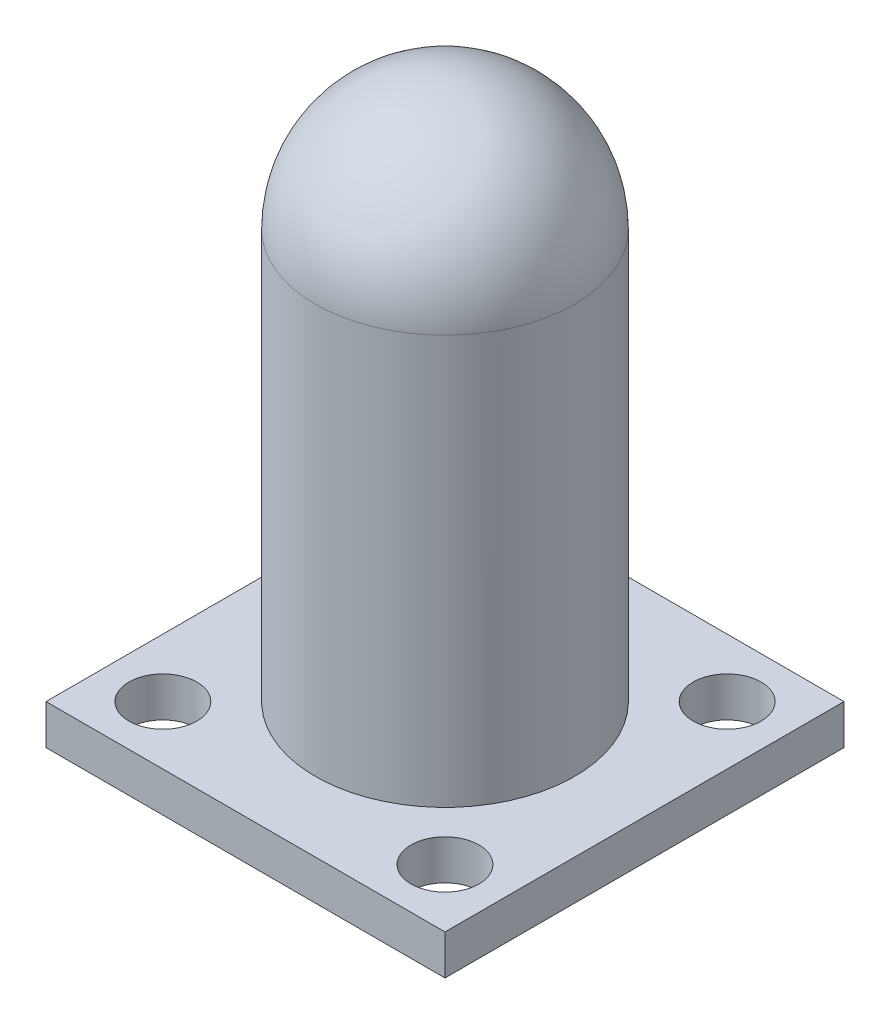
ISO-10303-21;
HEADER;
FILE_DESCRIPTION(('STEP AP214'),'2;1');
FILE_NAME('part.step','',(''),(''),'','','');
FILE_SCHEMA(('AUTOMOTIVE_DESIGN { 1 0 10303 214 1 1 1 1 }'));
ENDSEC;
DATA;
#1=APPLICATION_CONTEXT('core data for automotive mechanical design processes');
#2=APPLICATION_PROTOCOL_DEFINITION('international standard','automotive_design',2000,#1);
#3=PRODUCT_CONTEXT('',#1,'mechanical');
#4=PRODUCT('Part','Part','',(#3));
#5=PRODUCT_RELATED_PRODUCT_CATEGORY('part','',(#4));
#6=PRODUCT_DEFINITION_FORMATION('','',#4);
#7=PRODUCT_DEFINITION_CONTEXT('part definition',#1,'design');
#8=PRODUCT_DEFINITION('design','',#6,#7);
#9=PRODUCT_DEFINITION_SHAPE('','',#8);
#10=(LENGTH_UNIT() NAMED_UNIT(*) SI_UNIT(.MILLI.,.METRE.));
#11=(NAMED_UNIT(*) PLANE_ANGLE_UNIT() SI_UNIT($,.RADIAN.));
#12=(NAMED_UNIT(*) SI_UNIT($,.STERADIAN.) SOLID_ANGLE_UNIT());
#13=UNCERTAINTY_MEASURE_WITH_UNIT(LENGTH_MEASURE(1.E-05),#10,'distance_accuracy_value','');
#14=(GEOMETRIC_REPRESENTATION_CONTEXT(3) GLOBAL_UNCERTAINTY_ASSIGNED_CONTEXT((#13)) GLOBAL_UNIT_ASSIGNED_CONTEXT((#10,
#11,#12)) REPRESENTATION_CONTEXT('',''));
#15=CARTESIAN_POINT('',(0.,0.,0.));
#16=DIRECTION('',(0.,0.,1.));
#17=DIRECTION('',(1.,0.,0.));
#18=AXIS2_PLACEMENT_3D('',#15,#16,#17);
#19=CARTESIAN_POINT('',(0.,0.,0.));
#20=DIRECTION('',(0.,-1.,0.));
#21=DIRECTION('',(0.,0.,-1.));
#22=AXIS2_PLACEMENT_3D('',#19,#20,#21);
#23=CYLINDRICAL_SURFACE('',#22,6.5);
#24=CARTESIAN_POINT('',(0.,20.5,0.));
#25=DIRECTION('',(0.,-1.,0.));
#26=DIRECTION('',(0.,0.,-1.));
#27=AXIS2_PLACEMENT_3D('',#24,#25,#26);
#28=CIRCLE('',#27,6.5);
#29=CARTESIAN_POINT('',(0.,20.5,-6.5));
#30=VERTEX_POINT('',#29);
#31=EDGE_CURVE('E11',#30,#30,#28,.T.);
#32=ORIENTED_EDGE('',*,*,#31,.T.);
#33=EDGE_LOOP('',(#32));
#34=FACE_BOUND('',#33,.T.);
#35=CARTESIAN_POINT('',(0.,0.,0.));
#36=DIRECTION('',(0.,-1.,0.));
#37=DIRECTION('',(0.,0.,-1.));
#38=AXIS2_PLACEMENT_3D('',#35,#36,#37);
#39=CIRCLE('',#38,6.5);
#40=CARTESIAN_POINT('',(0.,0.,-6.5));
#41=VERTEX_POINT('',#40);
#42=EDGE_CURVE('E117',#41,#41,#39,.T.);
#43=ORIENTED_EDGE('',*,*,#42,.F.);
#44=EDGE_LOOP('',(#43));
#45=FACE_BOUND('',#44,.T.);
#46=ADVANCED_FACE('F36',(#34,#45),#23,.T.);
#47=CARTESIAN_POINT('',(0.,20.5,0.));
#48=DIRECTION('',(0.,-1.,0.));
#49=DIRECTION('',(1.,0.,0.));
#50=AXIS2_PLACEMENT_3D('',#47,#48,#49);
#51=SPHERICAL_SURFACE('',#50,6.5);
#52=ORIENTED_EDGE('',*,*,#31,.F.);
#53=EDGE_LOOP('',(#52));
#54=FACE_BOUND('',#53,.T.);
#55=ADVANCED_FACE('F148',(#54),#51,.T.);
#56=CARTESIAN_POINT('',(10.,-2.,-10.));
#57=DIRECTION('',(-1.,0.,0.));
#58=DIRECTION('',(0.,0.,1.));
#59=AXIS2_PLACEMENT_3D('',#56,#57,#58);
#60=PLANE('',#59);
#61=DIRECTION('',(0.,0.,1.));
#62=VECTOR('',#61,1.);
#63=CARTESIAN_POINT('',(10.,0.,-10.));
#64=LINE('',#63,#62);
#65=CARTESIAN_POINT('',(10.,0.,-10.));
#66=VERTEX_POINT('',#65);
#67=CARTESIAN_POINT('',(10.,0.,10.));
#68=VERTEX_POINT('',#67);
#69=EDGE_CURVE('E104',#66,#68,#64,.T.);
#70=ORIENTED_EDGE('',*,*,#69,.T.);
#71=DIRECTION('',(0.,1.,0.));
#72=VECTOR('',#71,1.);
#73=CARTESIAN_POINT('',(10.,-2.,10.));
#74=LINE('',#73,#72);
#75=CARTESIAN_POINT('',(10.,-2.,10.));
#76=VERTEX_POINT('',#75);
#77=EDGE_CURVE('E95',#76,#68,#74,.T.);
#78=ORIENTED_EDGE('',*,*,#77,.F.);
#79=DIRECTION('',(0.,0.,1.));
#80=VECTOR('',#79,1.);
#81=CARTESIAN_POINT('',(10.,-2.,-10.));
#82=LINE('',#81,#80);
#83=CARTESIAN_POINT('',(10.,-2.,-10.));
#84=VERTEX_POINT('',#83);
#85=EDGE_CURVE('E89',#84,#76,#82,.T.);
#86=ORIENTED_EDGE('',*,*,#85,.F.);
#87=DIRECTION('',(0.,1.,0.));
#88=VECTOR('',#87,1.);
#89=CARTESIAN_POINT('',(10.,-2.,-10.));
#90=LINE('',#89,#88);
#91=EDGE_CURVE('E100',#84,#66,#90,.T.);
#92=ORIENTED_EDGE('',*,*,#91,.T.);
#93=EDGE_LOOP('',(#70,#78,#86,#92));
#94=FACE_BOUND('',#93,.T.);
#95=ADVANCED_FACE('F150',(#94),#60,.F.);
#96=CARTESIAN_POINT('',(-10.,-2.,10.));
#97=DIRECTION('',(0.,0.,-1.));
#98=DIRECTION('',(-1.,0.,0.));
#99=AXIS2_PLACEMENT_3D('',#96,#97,#98);
#100=PLANE('',#99);
#101=DIRECTION('',(-1.,0.,0.));
#102=VECTOR('',#101,1.);
#103=CARTESIAN_POINT('',(-10.,0.,10.));
#104=LINE('',#103,#102);
#105=CARTESIAN_POINT('',(-10.,0.,10.));
#106=VERTEX_POINT('',#105);
#107=EDGE_CURVE('E94',#68,#106,#104,.T.);
#108=ORIENTED_EDGE('',*,*,#107,.T.);
#109=DIRECTION('',(0.,1.,0.));
#110=VECTOR('',#109,1.);
#111=CARTESIAN_POINT('',(-10.,-2.,10.));
#112=LINE('',#111,#110);
#113=CARTESIAN_POINT('',(-10.,-2.,10.));
#114=VERTEX_POINT('',#113);
#115=EDGE_CURVE('E92',#114,#106,#112,.T.);
#116=ORIENTED_EDGE('',*,*,#115,.F.);
#117=DIRECTION('',(-1.,0.,0.));
#118=VECTOR('',#117,1.);
#119=CARTESIAN_POINT('',(-10.,-2.,10.));
#120=LINE('',#119,#118);
#121=EDGE_CURVE('E84',#76,#114,#120,.T.);
#122=ORIENTED_EDGE('',*,*,#121,.F.);
#123=ORIENTED_EDGE('',*,*,#77,.T.);
#124=EDGE_LOOP('',(#108,#116,#122,#123));
#125=FACE_BOUND('',#124,.T.);
#126=ADVANCED_FACE('F93',(#125),#100,.F.);
#127=CARTESIAN_POINT('',(-10.,-2.,-10.));
#128=DIRECTION('',(1.,0.,0.));
#129=DIRECTION('',(0.,0.,-1.));
#130=AXIS2_PLACEMENT_3D('',#127,#128,#129);
#131=PLANE('',#130);
#132=DIRECTION('',(0.,0.,-1.));
#133=VECTOR('',#132,1.);
#134=CARTESIAN_POINT('',(-10.,0.,-10.));
#135=LINE('',#134,#133);
#136=CARTESIAN_POINT('',(-10.,0.,-10.));
#137=VERTEX_POINT('',#136);
#138=EDGE_CURVE('E70',#106,#137,#135,.T.);
#139=ORIENTED_EDGE('',*,*,#138,.T.);
#140=DIRECTION('',(0.,1.,0.));
#141=VECTOR('',#140,1.);
#142=CARTESIAN_POINT('',(-10.,-2.,-10.));
#143=LINE('',#142,#141);
#144=CARTESIAN_POINT('',(-10.,-2.,-10.));
#145=VERTEX_POINT('',#144);
#146=EDGE_CURVE('E96',#145,#137,#143,.T.);
#147=ORIENTED_EDGE('',*,*,#146,.F.);
#148=DIRECTION('',(0.,0.,-1.));
#149=VECTOR('',#148,1.);
#150=CARTESIAN_POINT('',(-10.,-2.,-10.));
#151=LINE('',#150,#149);
#152=EDGE_CURVE('E87',#114,#145,#151,.T.);
#153=ORIENTED_EDGE('',*,*,#152,.F.);
#154=ORIENTED_EDGE('',*,*,#115,.T.);
#155=EDGE_LOOP('',(#139,#147,#153,#154));
#156=FACE_BOUND('',#155,.T.);
#157=ADVANCED_FACE('F98',(#156),#131,.F.);
#158=CARTESIAN_POINT('',(-10.,-2.,-10.));
#159=DIRECTION('',(0.,0.,1.));
#160=DIRECTION('',(1.,0.,0.));
#161=AXIS2_PLACEMENT_3D('',#158,#159,#160);
#162=PLANE('',#161);
#163=DIRECTION('',(1.,0.,0.));
#164=VECTOR('',#163,1.);
#165=CARTESIAN_POINT('',(-10.,0.,-10.));
#166=LINE('',#165,#164);
#167=EDGE_CURVE('E76',#137,#66,#166,.T.);
#168=ORIENTED_EDGE('',*,*,#167,.T.);
#169=ORIENTED_EDGE('',*,*,#91,.F.);
#170=DIRECTION('',(1.,0.,0.));
#171=VECTOR('',#170,1.);
#172=CARTESIAN_POINT('',(-10.,-2.,-10.));
#173=LINE('',#172,#171);
#174=EDGE_CURVE('E53',#145,#84,#173,.T.);
#175=ORIENTED_EDGE('',*,*,#174,.F.);
#176=ORIENTED_EDGE('',*,*,#146,.T.);
#177=EDGE_LOOP('',(#168,#169,#175,#176));
#178=FACE_BOUND('',#177,.T.);
#179=ADVANCED_FACE('F164',(#178),#162,.F.);
#180=CARTESIAN_POINT('',(0.,-2.,0.));
#181=DIRECTION('',(0.,1.,0.));
#182=DIRECTION('',(0.,0.,1.));
#183=AXIS2_PLACEMENT_3D('',#180,#181,#182);
#184=PLANE('',#183);
#185=CARTESIAN_POINT('',(-7.07106781186547,-2.,-7.07106781186547));
#186=DIRECTION('',(0.,1.,0.));
#187=DIRECTION('',(0.,0.,1.));
#188=AXIS2_PLACEMENT_3D('',#185,#186,#187);
#189=CIRCLE('',#188,1.7);
#190=CARTESIAN_POINT('',(-7.07106781186547,-2.,-5.37106781186548));
#191=VERTEX_POINT('',#190);
#192=EDGE_CURVE('E250',#191,#191,#189,.T.);
#193=ORIENTED_EDGE('',*,*,#192,.T.);
#194=EDGE_LOOP('',(#193));
#195=FACE_BOUND('',#194,.T.);
#196=CARTESIAN_POINT('',(7.07106781186547,-2.,-7.07106781186548));
#197=DIRECTION('',(0.,1.,0.));
#198=DIRECTION('',(0.,0.,1.));
#199=AXIS2_PLACEMENT_3D('',#196,#197,#198);
#200=CIRCLE('',#199,1.7);
#201=CARTESIAN_POINT('',(7.07106781186547,-2.,-5.37106781186548));
#202=VERTEX_POINT('',#201);
#203=EDGE_CURVE('E254',#202,#202,#200,.T.);
#204=ORIENTED_EDGE('',*,*,#203,.T.);
#205=EDGE_LOOP('',(#204));
#206=FACE_BOUND('',#205,.T.);
#207=CARTESIAN_POINT('',(7.07106781186547,-2.,7.07106781186547));
#208=DIRECTION('',(0.,1.,0.));
#209=DIRECTION('',(0.,0.,1.));
#210=AXIS2_PLACEMENT_3D('',#207,#208,#209);
#211=CIRCLE('',#210,1.7);
#212=CARTESIAN_POINT('',(7.07106781186547,-2.,8.77106781186547));
#213=VERTEX_POINT('',#212);
#214=EDGE_CURVE('E263',#213,#213,#211,.T.);
#215=ORIENTED_EDGE('',*,*,#214,.T.);
#216=EDGE_LOOP('',(#215));
#217=FACE_BOUND('',#216,.T.);
#218=CARTESIAN_POINT('',(-7.07106781186547,-2.,7.07106781186547));
#219=DIRECTION('',(0.,1.,0.));
#220=DIRECTION('',(0.,0.,1.));
#221=AXIS2_PLACEMENT_3D('',#218,#219,#220);
#222=CIRCLE('',#221,1.7);
#223=CARTESIAN_POINT('',(-7.07106781186547,-2.,8.77106781186547));
#224=VERTEX_POINT('',#223);
#225=EDGE_CURVE('E107',#224,#224,#222,.T.);
#226=ORIENTED_EDGE('',*,*,#225,.T.);
#227=EDGE_LOOP('',(#226));
#228=FACE_BOUND('',#227,.T.);
#229=ORIENTED_EDGE('',*,*,#85,.T.);
#230=ORIENTED_EDGE('',*,*,#121,.T.);
#231=ORIENTED_EDGE('',*,*,#152,.T.);
#232=ORIENTED_EDGE('',*,*,#174,.T.);
#233=EDGE_LOOP('',(#229,#230,#231,#232));
#234=FACE_BOUND('',#233,.T.);
#235=ADVANCED_FACE('F85',(#195,#206,#217,#228,#234),#184,.F.);
#236=CARTESIAN_POINT('',(0.,0.,0.));
#237=DIRECTION('',(0.,1.,0.));
#238=DIRECTION('',(0.,0.,1.));
#239=AXIS2_PLACEMENT_3D('',#236,#237,#238);
#240=PLANE('',#239);
#241=CARTESIAN_POINT('',(-7.07106781186547,0.,-7.07106781186547));
#242=DIRECTION('',(0.,1.,0.));
#243=DIRECTION('',(0.,0.,1.));
#244=AXIS2_PLACEMENT_3D('',#241,#242,#243);
#245=CIRCLE('',#244,1.7);
#246=CARTESIAN_POINT('',(-7.07106781186547,0.,-5.37106781186548));
#247=VERTEX_POINT('',#246);
#248=EDGE_CURVE('E247',#247,#247,#245,.T.);
#249=ORIENTED_EDGE('',*,*,#248,.F.);
#250=EDGE_LOOP('',(#249));
#251=FACE_BOUND('',#250,.T.);
#252=CARTESIAN_POINT('',(7.07106781186547,0.,-7.07106781186548));
#253=DIRECTION('',(0.,1.,0.));
#254=DIRECTION('',(0.,0.,1.));
#255=AXIS2_PLACEMENT_3D('',#252,#253,#254);
#256=CIRCLE('',#255,1.7);
#257=CARTESIAN_POINT('',(7.07106781186547,0.,-5.37106781186548));
#258=VERTEX_POINT('',#257);
#259=EDGE_CURVE('E251',#258,#258,#256,.T.);
#260=ORIENTED_EDGE('',*,*,#259,.F.);
#261=EDGE_LOOP('',(#260));
#262=FACE_BOUND('',#261,.T.);
#263=CARTESIAN_POINT('',(7.07106781186547,0.,7.07106781186547));
#264=DIRECTION('',(0.,1.,0.));
#265=DIRECTION('',(0.,0.,1.));
#266=AXIS2_PLACEMENT_3D('',#263,#264,#265);
#267=CIRCLE('',#266,1.7);
#268=CARTESIAN_POINT('',(7.07106781186547,0.,8.77106781186547));
#269=VERTEX_POINT('',#268);
#270=EDGE_CURVE('E260',#269,#269,#267,.T.);
#271=ORIENTED_EDGE('',*,*,#270,.F.);
#272=EDGE_LOOP('',(#271));
#273=FACE_BOUND('',#272,.T.);
#274=CARTESIAN_POINT('',(-7.07106781186547,0.,7.07106781186547));
#275=DIRECTION('',(0.,1.,0.));
#276=DIRECTION('',(0.,0.,1.));
#277=AXIS2_PLACEMENT_3D('',#274,#275,#276);
#278=CIRCLE('',#277,1.7);
#279=CARTESIAN_POINT('',(-7.07106781186547,0.,8.77106781186547));
#280=VERTEX_POINT('',#279);
#281=EDGE_CURVE('E266',#280,#280,#278,.T.);
#282=ORIENTED_EDGE('',*,*,#281,.F.);
#283=EDGE_LOOP('',(#282));
#284=FACE_BOUND('',#283,.T.);
#285=ORIENTED_EDGE('',*,*,#42,.T.);
#286=EDGE_LOOP('',(#285));
#287=FACE_BOUND('',#286,.T.);
#288=ORIENTED_EDGE('',*,*,#69,.F.);
#289=ORIENTED_EDGE('',*,*,#167,.F.);
#290=ORIENTED_EDGE('',*,*,#138,.F.);
#291=ORIENTED_EDGE('',*,*,#107,.F.);
#292=EDGE_LOOP('',(#288,#289,#290,#291));
#293=FACE_BOUND('',#292,.T.);
#294=ADVANCED_FACE('F134',(#251,#262,#273,#284,#287,#293),#240,.T.);
#295=CARTESIAN_POINT('',(-7.07106781186547,0.,7.07106781186547));
#296=DIRECTION('',(0.,1.,0.));
#297=DIRECTION('',(0.,0.,1.));
#298=AXIS2_PLACEMENT_3D('',#295,#296,#297);
#299=CYLINDRICAL_SURFACE('',#298,1.7);
#300=ORIENTED_EDGE('',*,*,#281,.T.);
#301=EDGE_LOOP('',(#300));
#302=FACE_BOUND('',#301,.T.);
#303=ORIENTED_EDGE('',*,*,#225,.F.);
#304=EDGE_LOOP('',(#303));
#305=FACE_BOUND('',#304,.T.);
#306=ADVANCED_FACE('F140',(#302,#305),#299,.F.);
#307=CARTESIAN_POINT('',(7.07106781186547,0.,7.07106781186547));
#308=DIRECTION('',(0.,1.,0.));
#309=DIRECTION('',(0.,0.,1.));
#310=AXIS2_PLACEMENT_3D('',#307,#308,#309);
#311=CYLINDRICAL_SURFACE('',#310,1.7);
#312=ORIENTED_EDGE('',*,*,#270,.T.);
#313=EDGE_LOOP('',(#312));
#314=FACE_BOUND('',#313,.T.);
#315=ORIENTED_EDGE('',*,*,#214,.F.);
#316=EDGE_LOOP('',(#315));
#317=FACE_BOUND('',#316,.T.);
#318=ADVANCED_FACE('F211',(#314,#317),#311,.F.);
#319=CARTESIAN_POINT('',(7.07106781186547,0.,-7.07106781186548));
#320=DIRECTION('',(0.,1.,0.));
#321=DIRECTION('',(0.,0.,1.));
#322=AXIS2_PLACEMENT_3D('',#319,#320,#321);
#323=CYLINDRICAL_SURFACE('',#322,1.7);
#324=ORIENTED_EDGE('',*,*,#259,.T.);
#325=EDGE_LOOP('',(#324));
#326=FACE_BOUND('',#325,.T.);
#327=ORIENTED_EDGE('',*,*,#203,.F.);
#328=EDGE_LOOP('',(#327));
#329=FACE_BOUND('',#328,.T.);
#330=ADVANCED_FACE('F221',(#326,#329),#323,.F.);
#331=CARTESIAN_POINT('',(-7.07106781186547,0.,-7.07106781186547));
#332=DIRECTION('',(0.,1.,0.));
#333=DIRECTION('',(0.,0.,1.));
#334=AXIS2_PLACEMENT_3D('',#331,#332,#333);
#335=CYLINDRICAL_SURFACE('',#334,1.7);
#336=ORIENTED_EDGE('',*,*,#248,.T.);
#337=EDGE_LOOP('',(#336));
#338=FACE_BOUND('',#337,.T.);
#339=ORIENTED_EDGE('',*,*,#192,.F.);
#340=EDGE_LOOP('',(#339));
#341=FACE_BOUND('',#340,.T.);
#342=ADVANCED_FACE('F231',(#338,#341),#335,.F.);
#343=CLOSED_SHELL('',(#46,#55,#95,#126,#157,#179,#235,#294,#306,#318,#330,#342));
#344=CARTESIAN_POINT('',(0.,20.5,0.));
#345=DIRECTION('',(0.,-1.,0.));
#346=DIRECTION('',(1.,0.,0.));
#347=AXIS2_PLACEMENT_3D('',#344,#345,#346);
#348=SPHERICAL_SURFACE('',#347,4.);
#349=CARTESIAN_POINT('',(0.,20.5,0.));
#350=DIRECTION('',(0.,-1.,0.));
#351=DIRECTION('',(0.,0.,-1.));
#352=AXIS2_PLACEMENT_3D('',#349,#350,#351);
#353=CIRCLE('',#352,4.);
#354=CARTESIAN_POINT('',(0.,20.5,-4.));
#355=VERTEX_POINT('',#354);
#356=EDGE_CURVE('E45',#355,#355,#353,.T.);
#357=ORIENTED_EDGE('',*,*,#356,.T.);
#358=EDGE_LOOP('',(#357));
#359=FACE_BOUND('',#358,.T.);
#360=ADVANCED_FACE('F122',(#359),#348,.F.);
#361=CARTESIAN_POINT('',(0.,0.,0.));
#362=DIRECTION('',(0.,-1.,0.));
#363=DIRECTION('',(0.,0.,-1.));
#364=AXIS2_PLACEMENT_3D('',#361,#362,#363);
#365=CYLINDRICAL_SURFACE('',#364,4.);
#366=ORIENTED_EDGE('',*,*,#356,.F.);
#367=EDGE_LOOP('',(#366));
#368=FACE_BOUND('',#367,.T.);
#369=CARTESIAN_POINT('',(0.,0.,0.));
#370=DIRECTION('',(0.,1.,0.));
#371=DIRECTION('',(0.,0.,1.));
#372=AXIS2_PLACEMENT_3D('',#369,#370,#371);
#373=CIRCLE('',#372,4.);
#374=CARTESIAN_POINT('',(0.,0.,4.));
#375=VERTEX_POINT('',#374);
#376=EDGE_CURVE('E114',#375,#375,#373,.F.);
#377=ORIENTED_EDGE('',*,*,#376,.T.);
#378=EDGE_LOOP('',(#377));
#379=FACE_BOUND('',#378,.T.);
#380=ADVANCED_FACE('F124',(#368,#379),#365,.F.);
#381=ORIENTED_EDGE('',*,*,#376,.F.);
#382=EDGE_LOOP('',(#381));
#383=FACE_BOUND('',#382,.T.);
#384=ADVANCED_FACE('F127',(#383),#240,.T.);
#385=CLOSED_SHELL('',(#360,#380,#384));
#386=ORIENTED_CLOSED_SHELL('',*,#385,.T.);
#387=BREP_WITH_VOIDS('B2',#343,(#386));
#388=ADVANCED_BREP_SHAPE_REPRESENTATION('',(#18,#387),#14);
#389=SHAPE_DEFINITION_REPRESENTATION(#9,#388);
ENDSEC;
END-ISO-10303-21;
